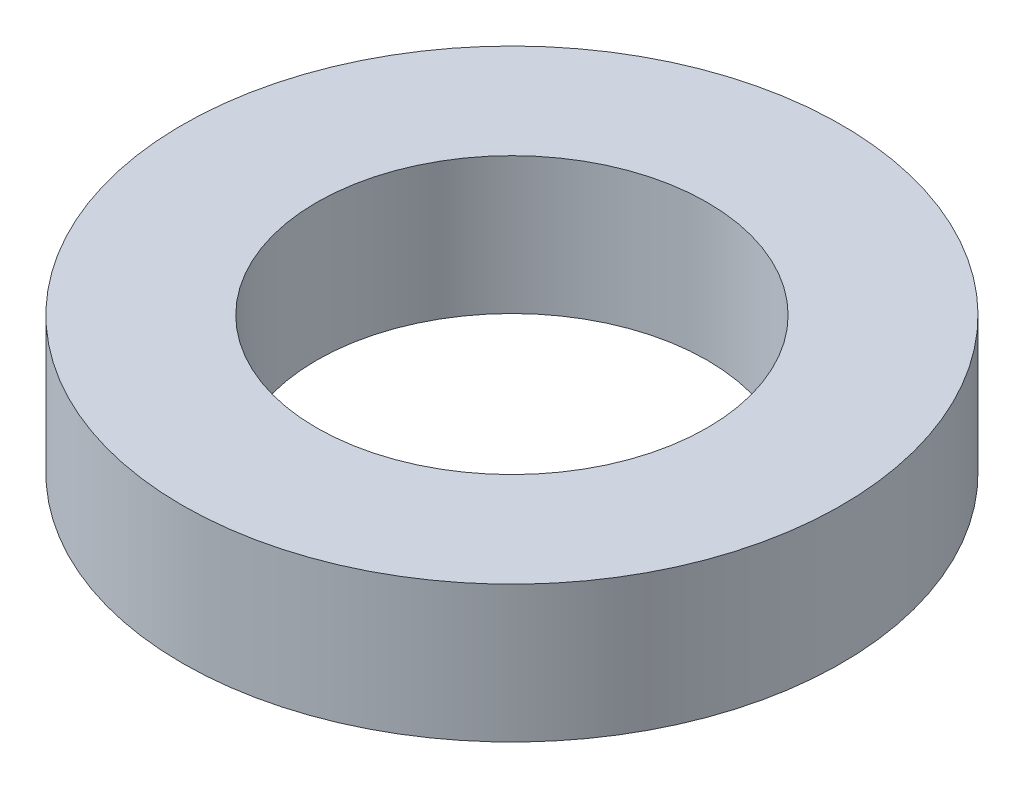
ISO-10303-21;
HEADER;
FILE_DESCRIPTION(('STEP AP214'),'2;1');
FILE_NAME('part.step','',(''),(''),'','','');
FILE_SCHEMA(('AUTOMOTIVE_DESIGN { 1 0 10303 214 1 1 1 1 }'));
ENDSEC;
DATA;
#1=APPLICATION_CONTEXT('core data for automotive mechanical design processes');
#2=APPLICATION_PROTOCOL_DEFINITION('international standard','automotive_design',2000,#1);
#3=PRODUCT_CONTEXT('',#1,'mechanical');
#4=PRODUCT('Part','Part','',(#3));
#5=PRODUCT_RELATED_PRODUCT_CATEGORY('part','',(#4));
#6=PRODUCT_DEFINITION_FORMATION('','',#4);
#7=PRODUCT_DEFINITION_CONTEXT('part definition',#1,'design');
#8=PRODUCT_DEFINITION('design','',#6,#7);
#9=PRODUCT_DEFINITION_SHAPE('','',#8);
#10=(LENGTH_UNIT() NAMED_UNIT(*) SI_UNIT(.MILLI.,.METRE.));
#11=(NAMED_UNIT(*) PLANE_ANGLE_UNIT() SI_UNIT($,.RADIAN.));
#12=(NAMED_UNIT(*) SI_UNIT($,.STERADIAN.) SOLID_ANGLE_UNIT());
#13=UNCERTAINTY_MEASURE_WITH_UNIT(LENGTH_MEASURE(1.E-05),#10,'distance_accuracy_value','');
#14=(GEOMETRIC_REPRESENTATION_CONTEXT(3) GLOBAL_UNCERTAINTY_ASSIGNED_CONTEXT((#13)) GLOBAL_UNIT_ASSIGNED_CONTEXT((#10,
#11,#12)) REPRESENTATION_CONTEXT('',''));
#15=CARTESIAN_POINT('',(0.,0.,0.));
#16=DIRECTION('',(0.,0.,1.));
#17=DIRECTION('',(1.,0.,0.));
#18=AXIS2_PLACEMENT_3D('',#15,#16,#17);
#19=CARTESIAN_POINT('',(0.,28.,0.));
#20=DIRECTION('',(0.,-1.,0.));
#21=DIRECTION('',(0.,0.,-1.));
#22=AXIS2_PLACEMENT_3D('',#19,#20,#21);
#23=CYLINDRICAL_SURFACE('',#22,67.5);
#24=CARTESIAN_POINT('',(0.,28.,0.));
#25=DIRECTION('',(0.,1.,0.));
#26=DIRECTION('',(0.,0.,1.));
#27=AXIS2_PLACEMENT_3D('',#24,#25,#26);
#28=CIRCLE('',#27,67.5);
#29=CARTESIAN_POINT('',(0.,28.,67.5));
#30=VERTEX_POINT('',#29);
#31=EDGE_CURVE('E10',#30,#30,#28,.T.);
#32=ORIENTED_EDGE('',*,*,#31,.F.);
#33=EDGE_LOOP('',(#32));
#34=FACE_BOUND('',#33,.T.);
#35=CARTESIAN_POINT('',(0.,0.,0.));
#36=DIRECTION('',(0.,1.,0.));
#37=DIRECTION('',(0.,0.,1.));
#38=AXIS2_PLACEMENT_3D('',#35,#36,#37);
#39=CIRCLE('',#38,67.5);
#40=CARTESIAN_POINT('',(0.,0.,67.5));
#41=VERTEX_POINT('',#40);
#42=EDGE_CURVE('E37',#41,#41,#39,.T.);
#43=ORIENTED_EDGE('',*,*,#42,.T.);
#44=EDGE_LOOP('',(#43));
#45=FACE_BOUND('',#44,.T.);
#46=ADVANCED_FACE('F40',(#34,#45),#23,.T.);
#47=CARTESIAN_POINT('',(0.,28.,0.));
#48=DIRECTION('',(0.,1.,0.));
#49=DIRECTION('',(0.,0.,1.));
#50=AXIS2_PLACEMENT_3D('',#47,#48,#49);
#51=PLANE('',#50);
#52=CARTESIAN_POINT('',(0.,28.,0.));
#53=DIRECTION('',(0.,1.,0.));
#54=DIRECTION('',(0.,0.,1.));
#55=AXIS2_PLACEMENT_3D('',#52,#53,#54);
#56=CIRCLE('',#55,40.);
#57=CARTESIAN_POINT('',(0.,28.,40.));
#58=VERTEX_POINT('',#57);
#59=EDGE_CURVE('E50',#58,#58,#56,.T.);
#60=ORIENTED_EDGE('',*,*,#59,.F.);
#61=EDGE_LOOP('',(#60));
#62=FACE_BOUND('',#61,.T.);
#63=ORIENTED_EDGE('',*,*,#31,.T.);
#64=EDGE_LOOP('',(#63));
#65=FACE_BOUND('',#64,.T.);
#66=ADVANCED_FACE('F59',(#62,#65),#51,.T.);
#67=CARTESIAN_POINT('',(0.,0.,0.));
#68=DIRECTION('',(0.,1.,0.));
#69=DIRECTION('',(0.,0.,1.));
#70=AXIS2_PLACEMENT_3D('',#67,#68,#69);
#71=PLANE('',#70);
#72=CARTESIAN_POINT('',(0.,0.,0.));
#73=DIRECTION('',(0.,1.,0.));
#74=DIRECTION('',(0.,0.,1.));
#75=AXIS2_PLACEMENT_3D('',#72,#73,#74);
#76=CIRCLE('',#75,40.);
#77=CARTESIAN_POINT('',(0.,0.,40.));
#78=VERTEX_POINT('',#77);
#79=EDGE_CURVE('E47',#78,#78,#76,.T.);
#80=ORIENTED_EDGE('',*,*,#79,.T.);
#81=EDGE_LOOP('',(#80));
#82=FACE_BOUND('',#81,.T.);
#83=ORIENTED_EDGE('',*,*,#42,.F.);
#84=EDGE_LOOP('',(#83));
#85=FACE_BOUND('',#84,.T.);
#86=ADVANCED_FACE('F58',(#82,#85),#71,.F.);
#87=CARTESIAN_POINT('',(0.,28.,0.));
#88=DIRECTION('',(0.,-1.,0.));
#89=DIRECTION('',(0.,0.,-1.));
#90=AXIS2_PLACEMENT_3D('',#87,#88,#89);
#91=CYLINDRICAL_SURFACE('',#90,40.);
#92=ORIENTED_EDGE('',*,*,#59,.T.);
#93=EDGE_LOOP('',(#92));
#94=FACE_BOUND('',#93,.T.);
#95=ORIENTED_EDGE('',*,*,#79,.F.);
#96=EDGE_LOOP('',(#95));
#97=FACE_BOUND('',#96,.T.);
#98=ADVANCED_FACE('F54',(#94,#97),#91,.F.);
#99=CLOSED_SHELL('',(#46,#66,#86,#98));
#100=MANIFOLD_SOLID_BREP('B2',#99);
#101=ADVANCED_BREP_SHAPE_REPRESENTATION('',(#18,#100),#14);
#102=SHAPE_DEFINITION_REPRESENTATION(#9,#101);
ENDSEC;
END-ISO-10303-21;
